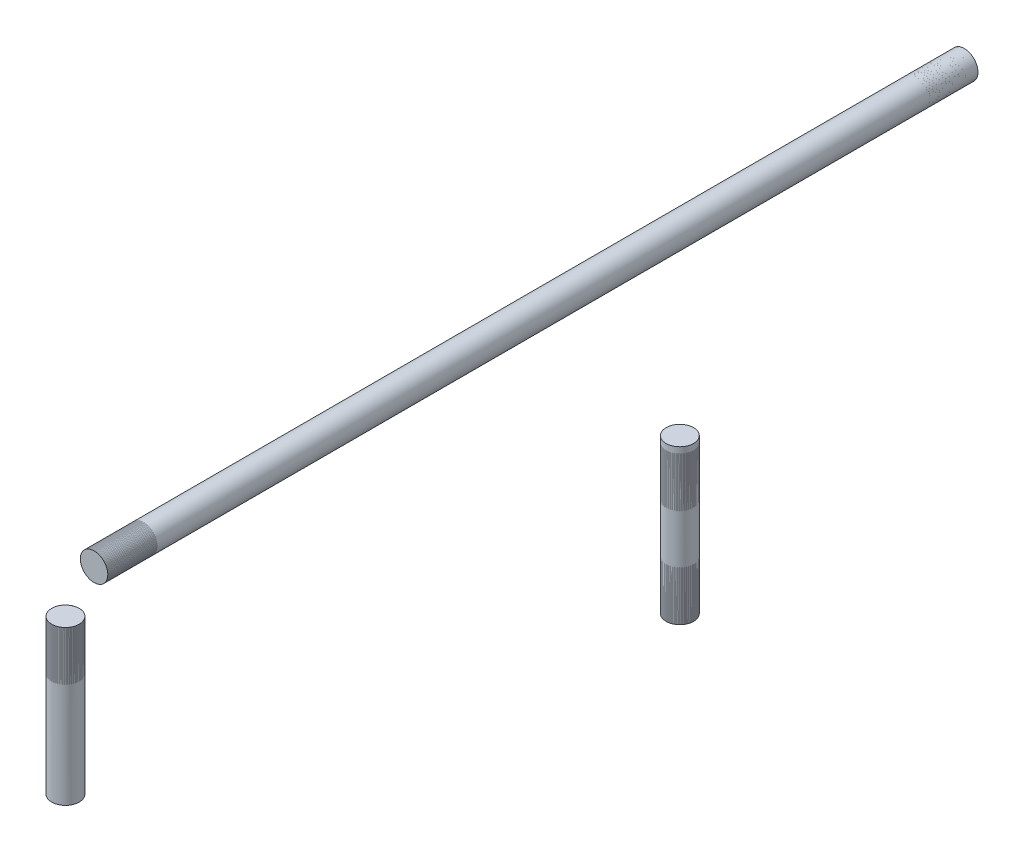
ISO-10303-21;
HEADER;
FILE_DESCRIPTION(('STEP AP214'),'2;1');
FILE_NAME('part.step','',(''),(''),'','','');
FILE_SCHEMA(('AUTOMOTIVE_DESIGN { 1 0 10303 214 1 1 1 1 }'));
ENDSEC;
DATA;
#1=APPLICATION_CONTEXT('core data for automotive mechanical design processes');
#2=APPLICATION_PROTOCOL_DEFINITION('international standard','automotive_design',2000,#1);
#3=PRODUCT_CONTEXT('',#1,'mechanical');
#4=PRODUCT('Part','Part','',(#3));
#5=PRODUCT_RELATED_PRODUCT_CATEGORY('part','',(#4));
#6=PRODUCT_DEFINITION_FORMATION('','',#4);
#7=PRODUCT_DEFINITION_CONTEXT('part definition',#1,'design');
#8=PRODUCT_DEFINITION('design','',#6,#7);
#9=PRODUCT_DEFINITION_SHAPE('','',#8);
#10=(LENGTH_UNIT() NAMED_UNIT(*) SI_UNIT(.MILLI.,.METRE.));
#11=(NAMED_UNIT(*) PLANE_ANGLE_UNIT() SI_UNIT($,.RADIAN.));
#12=(NAMED_UNIT(*) SI_UNIT($,.STERADIAN.) SOLID_ANGLE_UNIT());
#13=UNCERTAINTY_MEASURE_WITH_UNIT(LENGTH_MEASURE(1.E-05),#10,'distance_accuracy_value','');
#14=(GEOMETRIC_REPRESENTATION_CONTEXT(3) GLOBAL_UNCERTAINTY_ASSIGNED_CONTEXT((#13)) GLOBAL_UNIT_ASSIGNED_CONTEXT((#10,
#11,#12)) REPRESENTATION_CONTEXT('',''));
#15=CARTESIAN_POINT('',(0.,0.,0.));
#16=DIRECTION('',(0.,0.,1.));
#17=DIRECTION('',(1.,0.,0.));
#18=AXIS2_PLACEMENT_3D('',#15,#16,#17);
#19=CARTESIAN_POINT('',(0.,0.,378.968));
#20=DIRECTION('',(0.,0.,-1.));
#21=DIRECTION('',(-1.,0.,0.));
#22=AXIS2_PLACEMENT_3D('',#19,#20,#21);
#23=PLANE('',#22);
#24=CARTESIAN_POINT('',(0.,0.,378.968));
#25=DIRECTION('',(0.,0.,-1.));
#26=DIRECTION('',(-1.,0.,0.));
#27=AXIS2_PLACEMENT_3D('',#24,#25,#26);
#28=CIRCLE('',#27,6.35000000000019);
#29=CARTESIAN_POINT('',(-6.35000000000011,0.,378.968));
#30=VERTEX_POINT('',#29);
#31=EDGE_CURVE('E50',#30,#30,#28,.T.);
#32=ORIENTED_EDGE('',*,*,#31,.F.);
#33=EDGE_LOOP('',(#32));
#34=FACE_BOUND('',#33,.T.);
#35=ADVANCED_FACE('F43',(#34),#23,.F.);
#36=CARTESIAN_POINT('',(0.,0.,-40.8205122421388));
#37=DIRECTION('',(0.,0.,1.));
#38=DIRECTION('',(1.,0.,0.));
#39=AXIS2_PLACEMENT_3D('',#36,#37,#38);
#40=CYLINDRICAL_SURFACE('',#39,6.35000000000019);
#41=CARTESIAN_POINT('',(0.,0.,-22.86));
#42=DIRECTION('',(0.,0.,1.));
#43=DIRECTION('',(1.,0.,0.));
#44=AXIS2_PLACEMENT_3D('',#41,#42,#43);
#45=CIRCLE('',#44,6.35000000000019);
#46=CARTESIAN_POINT('',(6.35000000000026,0.,-22.86));
#47=VERTEX_POINT('',#46);
#48=EDGE_CURVE('E11',#47,#47,#45,.T.);
#49=ORIENTED_EDGE('',*,*,#48,.T.);
#50=EDGE_LOOP('',(#49));
#51=FACE_BOUND('',#50,.T.);
#52=ORIENTED_EDGE('',*,*,#31,.T.);
#53=EDGE_LOOP('',(#52));
#54=FACE_BOUND('',#53,.T.);
#55=ADVANCED_FACE('F45',(#51,#54),#40,.T.);
#56=CARTESIAN_POINT('',(0.,0.,-22.86));
#57=DIRECTION('',(0.,0.,1.));
#58=DIRECTION('',(1.,0.,0.));
#59=AXIS2_PLACEMENT_3D('',#56,#57,#58);
#60=PLANE('',#59);
#61=ORIENTED_EDGE('',*,*,#48,.F.);
#62=EDGE_LOOP('',(#61));
#63=FACE_BOUND('',#62,.T.);
#64=ADVANCED_FACE('F61',(#63),#60,.F.);
#65=CLOSED_SHELL('',(#35,#55,#64));
#66=MANIFOLD_SOLID_BREP('B2',#65);
#67=CARTESIAN_POINT('',(-1.04571752314983E-13,-84.3661000000004,392.176));
#68=DIRECTION('',(0.,1.,0.));
#69=DIRECTION('',(0.,0.,1.));
#70=AXIS2_PLACEMENT_3D('',#67,#68,#69);
#71=PLANE('',#70);
#72=CARTESIAN_POINT('',(-1.04571752314983E-13,-84.3661000000004,392.176));
#73=DIRECTION('',(0.,1.,0.));
#74=DIRECTION('',(0.,0.,1.));
#75=AXIS2_PLACEMENT_3D('',#72,#73,#74);
#76=CIRCLE('',#75,6.35000000000002);
#77=CARTESIAN_POINT('',(-1.04571752314983E-13,-84.3661000000004,398.526));
#78=VERTEX_POINT('',#77);
#79=EDGE_CURVE('E98',#78,#78,#76,.T.);
#80=ORIENTED_EDGE('',*,*,#79,.F.);
#81=EDGE_LOOP('',(#80));
#82=FACE_BOUND('',#81,.T.);
#83=ADVANCED_FACE('F91',(#82),#71,.F.);
#84=CARTESIAN_POINT('',(0.,4.75251224213843,392.176));
#85=DIRECTION('',(0.,-1.,0.));
#86=DIRECTION('',(0.,0.,-1.));
#87=AXIS2_PLACEMENT_3D('',#84,#85,#86);
#88=CYLINDRICAL_SURFACE('',#87,6.35000000000002);
#89=CARTESIAN_POINT('',(0.,-13.2080000000001,392.176));
#90=DIRECTION('',(0.,-1.,0.));
#91=DIRECTION('',(0.,0.,-1.));
#92=AXIS2_PLACEMENT_3D('',#89,#90,#91);
#93=CIRCLE('',#92,6.35000000000002);
#94=CARTESIAN_POINT('',(0.,-13.2080000000001,385.826));
#95=VERTEX_POINT('',#94);
#96=EDGE_CURVE('E42',#95,#95,#93,.T.);
#97=ORIENTED_EDGE('',*,*,#96,.T.);
#98=EDGE_LOOP('',(#97));
#99=FACE_BOUND('',#98,.T.);
#100=ORIENTED_EDGE('',*,*,#79,.T.);
#101=EDGE_LOOP('',(#100));
#102=FACE_BOUND('',#101,.T.);
#103=ADVANCED_FACE('F93',(#99,#102),#88,.T.);
#104=CARTESIAN_POINT('',(0.,-13.2079999999996,0.));
#105=DIRECTION('',(0.,-1.,0.));
#106=DIRECTION('',(0.,0.,-1.));
#107=AXIS2_PLACEMENT_3D('',#104,#105,#106);
#108=PLANE('',#107);
#109=ORIENTED_EDGE('',*,*,#96,.F.);
#110=EDGE_LOOP('',(#109));
#111=FACE_BOUND('',#110,.T.);
#112=ADVANCED_FACE('F109',(#111),#108,.F.);
#113=CLOSED_SHELL('',(#83,#103,#112));
#114=MANIFOLD_SOLID_BREP('B6',#113);
#115=CARTESIAN_POINT('',(69.5833000000001,-84.3661000000003,178.054));
#116=DIRECTION('',(0.,1.,0.));
#117=DIRECTION('',(0.,0.,1.));
#118=AXIS2_PLACEMENT_3D('',#115,#116,#117);
#119=PLANE('',#118);
#120=CARTESIAN_POINT('',(69.5833000000001,-84.3661000000003,178.054));
#121=DIRECTION('',(0.,1.,0.));
#122=DIRECTION('',(0.,0.,1.));
#123=AXIS2_PLACEMENT_3D('',#120,#121,#122);
#124=CIRCLE('',#123,6.35000000000001);
#125=CARTESIAN_POINT('',(69.5833000000001,-84.3661000000003,184.404));
#126=VERTEX_POINT('',#125);
#127=EDGE_CURVE('E146',#126,#126,#124,.T.);
#128=ORIENTED_EDGE('',*,*,#127,.F.);
#129=EDGE_LOOP('',(#128));
#130=FACE_BOUND('',#129,.T.);
#131=ADVANCED_FACE('F139',(#130),#119,.F.);
#132=CARTESIAN_POINT('',(69.5833000000001,4.75251224213848,178.054));
#133=DIRECTION('',(0.,-1.,0.));
#134=DIRECTION('',(0.,0.,-1.));
#135=AXIS2_PLACEMENT_3D('',#132,#133,#134);
#136=CYLINDRICAL_SURFACE('',#135,6.35000000000001);
#137=CARTESIAN_POINT('',(69.5833000000001,-13.2079999999998,178.054));
#138=DIRECTION('',(0.,-1.,0.));
#139=DIRECTION('',(0.,0.,-1.));
#140=AXIS2_PLACEMENT_3D('',#137,#138,#139);
#141=CIRCLE('',#140,6.35000000000001);
#142=CARTESIAN_POINT('',(69.5833000000001,-13.2079999999998,171.704));
#143=VERTEX_POINT('',#142);
#144=EDGE_CURVE('E90',#143,#143,#141,.T.);
#145=ORIENTED_EDGE('',*,*,#144,.T.);
#146=EDGE_LOOP('',(#145));
#147=FACE_BOUND('',#146,.T.);
#148=ORIENTED_EDGE('',*,*,#127,.T.);
#149=EDGE_LOOP('',(#148));
#150=FACE_BOUND('',#149,.T.);
#151=ADVANCED_FACE('F141',(#147,#150),#136,.T.);
#152=CARTESIAN_POINT('',(0.,-13.2079999999996,0.));
#153=DIRECTION('',(0.,-1.,0.));
#154=DIRECTION('',(0.,0.,-1.));
#155=AXIS2_PLACEMENT_3D('',#152,#153,#154);
#156=PLANE('',#155);
#157=ORIENTED_EDGE('',*,*,#144,.F.);
#158=EDGE_LOOP('',(#157));
#159=FACE_BOUND('',#158,.T.);
#160=ADVANCED_FACE('F157',(#159),#156,.F.);
#161=CLOSED_SHELL('',(#131,#151,#160));
#162=MANIFOLD_SOLID_BREP('B37',#161);
#163=CARTESIAN_POINT('',(69.5833000000001,-27.432,178.054));
#164=DIRECTION('',(0.,1.,0.));
#165=DIRECTION('',(-1.,0.,0.));
#166=AXIS2_PLACEMENT_3D('',#163,#164,#165);
#167=CYLINDRICAL_SURFACE('',#166,6.35);
#168=CARTESIAN_POINT('',(69.5833000000001,-38.862,178.054));
#169=DIRECTION('',(0.,1.,0.));
#170=DIRECTION('',(-1.,0.,0.));
#171=AXIS2_PLACEMENT_3D('',#168,#169,#170);
#172=CIRCLE('',#171,6.35);
#173=CARTESIAN_POINT('',(63.2333000000001,-38.862,178.054));
#174=VERTEX_POINT('',#173);
#175=EDGE_CURVE('E191',#174,#174,#172,.T.);
#176=ORIENTED_EDGE('',*,*,#175,.F.);
#177=EDGE_LOOP('',(#176));
#178=FACE_BOUND('',#177,.T.);
#179=CARTESIAN_POINT('',(69.5833000000001,-16.002,178.054));
#180=DIRECTION('',(0.,1.,0.));
#181=DIRECTION('',(-1.,0.,0.));
#182=AXIS2_PLACEMENT_3D('',#179,#180,#181);
#183=CIRCLE('',#182,6.35);
#184=CARTESIAN_POINT('',(63.2333000000001,-16.002,178.054));
#185=VERTEX_POINT('',#184);
#186=EDGE_CURVE('E138',#185,#185,#183,.F.);
#187=ORIENTED_EDGE('',*,*,#186,.F.);
#188=EDGE_LOOP('',(#187));
#189=FACE_BOUND('',#188,.T.);
#190=ADVANCED_FACE('F187',(#178,#189),#167,.F.);
#191=OPEN_SHELL('',(#190));
#192=SHELL_BASED_SURFACE_MODEL('B85',(#191));
#193=CARTESIAN_POINT('',(69.5833000000001,-72.9361000000004,178.054));
#194=DIRECTION('',(0.,-1.,0.));
#195=DIRECTION('',(-0.451453370588833,0.,0.892294712628054));
#196=AXIS2_PLACEMENT_3D('',#193,#194,#195);
#197=CYLINDRICAL_SURFACE('',#196,6.35);
#198=CARTESIAN_POINT('',(69.5833000000001,-84.3661000000004,178.054));
#199=DIRECTION('',(0.,-1.,0.));
#200=DIRECTION('',(-0.451453370588833,0.,0.892294712628054));
#201=AXIS2_PLACEMENT_3D('',#198,#199,#200);
#202=CIRCLE('',#201,6.35);
#203=CARTESIAN_POINT('',(66.716571096761,-84.3661000000004,183.720071425188));
#204=VERTEX_POINT('',#203);
#205=EDGE_CURVE('E225',#204,#204,#202,.F.);
#206=ORIENTED_EDGE('',*,*,#205,.F.);
#207=EDGE_LOOP('',(#206));
#208=FACE_BOUND('',#207,.T.);
#209=CARTESIAN_POINT('',(69.5833000000001,-61.5061000000004,178.054));
#210=DIRECTION('',(0.,-1.,0.));
#211=DIRECTION('',(-0.451453370588833,0.,0.892294712628054));
#212=AXIS2_PLACEMENT_3D('',#209,#210,#211);
#213=CIRCLE('',#212,6.35);
#214=CARTESIAN_POINT('',(66.716571096761,-61.5061000000004,183.720071425188));
#215=VERTEX_POINT('',#214);
#216=EDGE_CURVE('E186',#215,#215,#213,.T.);
#217=ORIENTED_EDGE('',*,*,#216,.F.);
#218=EDGE_LOOP('',(#217));
#219=FACE_BOUND('',#218,.T.);
#220=ADVANCED_FACE('F221',(#208,#219),#197,.F.);
#221=OPEN_SHELL('',(#220));
#222=SHELL_BASED_SURFACE_MODEL('B133',(#221));
#223=CARTESIAN_POINT('',(0.,0.,367.538));
#224=DIRECTION('',(0.,0.,1.));
#225=DIRECTION('',(0.,-1.,0.));
#226=AXIS2_PLACEMENT_3D('',#223,#224,#225);
#227=CYLINDRICAL_SURFACE('',#226,6.35);
#228=CARTESIAN_POINT('',(0.,0.,356.108));
#229=DIRECTION('',(0.,0.,1.));
#230=DIRECTION('',(0.,-1.,0.));
#231=AXIS2_PLACEMENT_3D('',#228,#229,#230);
#232=CIRCLE('',#231,6.35);
#233=CARTESIAN_POINT('',(0.,-6.35000000000006,356.108));
#234=VERTEX_POINT('',#233);
#235=EDGE_CURVE('E220',#234,#234,#232,.T.);
#236=ORIENTED_EDGE('',*,*,#235,.F.);
#237=EDGE_LOOP('',(#236));
#238=FACE_BOUND('',#237,.T.);
#239=CARTESIAN_POINT('',(0.,0.,378.968));
#240=DIRECTION('',(0.,0.,1.));
#241=DIRECTION('',(0.,-1.,0.));
#242=AXIS2_PLACEMENT_3D('',#239,#240,#241);
#243=CIRCLE('',#242,6.35);
#244=CARTESIAN_POINT('',(0.,-6.35000000000008,378.968));
#245=VERTEX_POINT('',#244);
#246=EDGE_CURVE('E259',#245,#245,#243,.F.);
#247=ORIENTED_EDGE('',*,*,#246,.F.);
#248=EDGE_LOOP('',(#247));
#249=FACE_BOUND('',#248,.T.);
#250=ADVANCED_FACE('F255',(#238,#249),#227,.F.);
#251=OPEN_SHELL('',(#250));
#252=SHELL_BASED_SURFACE_MODEL('B181',(#251));
#253=CARTESIAN_POINT('',(0.,-24.6380000000001,392.176));
#254=DIRECTION('',(0.,1.,0.));
#255=DIRECTION('',(0.,0.,1.));
#256=AXIS2_PLACEMENT_3D('',#253,#254,#255);
#257=CYLINDRICAL_SURFACE('',#256,6.35);
#258=CARTESIAN_POINT('',(0.,-36.0680000000001,392.176));
#259=DIRECTION('',(0.,1.,0.));
#260=DIRECTION('',(0.,0.,1.));
#261=AXIS2_PLACEMENT_3D('',#258,#259,#260);
#262=CIRCLE('',#261,6.35);
#263=CARTESIAN_POINT('',(0.,-36.0680000000001,398.526));
#264=VERTEX_POINT('',#263);
#265=EDGE_CURVE('E290',#264,#264,#262,.T.);
#266=ORIENTED_EDGE('',*,*,#265,.F.);
#267=EDGE_LOOP('',(#266));
#268=FACE_BOUND('',#267,.T.);
#269=CARTESIAN_POINT('',(0.,-13.2080000000001,392.176));
#270=DIRECTION('',(0.,1.,0.));
#271=DIRECTION('',(0.,0.,1.));
#272=AXIS2_PLACEMENT_3D('',#269,#270,#271);
#273=CIRCLE('',#272,6.35);
#274=CARTESIAN_POINT('',(0.,-13.2080000000001,398.526));
#275=VERTEX_POINT('',#274);
#276=EDGE_CURVE('E254',#275,#275,#273,.F.);
#277=ORIENTED_EDGE('',*,*,#276,.F.);
#278=EDGE_LOOP('',(#277));
#279=FACE_BOUND('',#278,.T.);
#280=ADVANCED_FACE('F286',(#268,#279),#257,.F.);
#281=OPEN_SHELL('',(#280));
#282=SHELL_BASED_SURFACE_MODEL('B215',(#281));
#283=CARTESIAN_POINT('',(0.,0.,-11.43));
#284=DIRECTION('',(0.,0.,-1.));
#285=DIRECTION('',(1.,0.,0.));
#286=AXIS2_PLACEMENT_3D('',#283,#284,#285);
#287=CYLINDRICAL_SURFACE('',#286,6.35);
#288=CARTESIAN_POINT('',(0.,0.,0.));
#289=DIRECTION('',(0.,0.,-1.));
#290=DIRECTION('',(1.,0.,0.));
#291=AXIS2_PLACEMENT_3D('',#288,#289,#290);
#292=CIRCLE('',#291,6.35);
#293=CARTESIAN_POINT('',(6.35,0.,0.));
#294=VERTEX_POINT('',#293);
#295=EDGE_CURVE('E314',#294,#294,#292,.T.);
#296=ORIENTED_EDGE('',*,*,#295,.F.);
#297=EDGE_LOOP('',(#296));
#298=FACE_BOUND('',#297,.T.);
#299=CARTESIAN_POINT('',(0.,0.,-22.86));
#300=DIRECTION('',(0.,0.,-1.));
#301=DIRECTION('',(1.,0.,0.));
#302=AXIS2_PLACEMENT_3D('',#299,#300,#301);
#303=CIRCLE('',#302,6.35);
#304=CARTESIAN_POINT('',(6.35,0.,-22.86));
#305=VERTEX_POINT('',#304);
#306=EDGE_CURVE('E285',#305,#305,#303,.F.);
#307=ORIENTED_EDGE('',*,*,#306,.F.);
#308=EDGE_LOOP('',(#307));
#309=FACE_BOUND('',#308,.T.);
#310=ADVANCED_FACE('F310',(#298,#309),#287,.F.);
#311=OPEN_SHELL('',(#310));
#312=SHELL_BASED_SURFACE_MODEL('B249',(#311));
#313=ADVANCED_BREP_SHAPE_REPRESENTATION('',(#18,#66,#114,#162),#14);
#314=MANIFOLD_SURFACE_SHAPE_REPRESENTATION('',(#18,#192,#222,#252,#282,#312),#14);
#315=SHAPE_REPRESENTATION('',(#18),#14);
#316=SHAPE_DEFINITION_REPRESENTATION(#9,#315);
#317=SHAPE_REPRESENTATION_RELATIONSHIP('','',#315,#313);
#318=SHAPE_REPRESENTATION_RELATIONSHIP('','',#315,#314);
ENDSEC;
END-ISO-10303-21;
